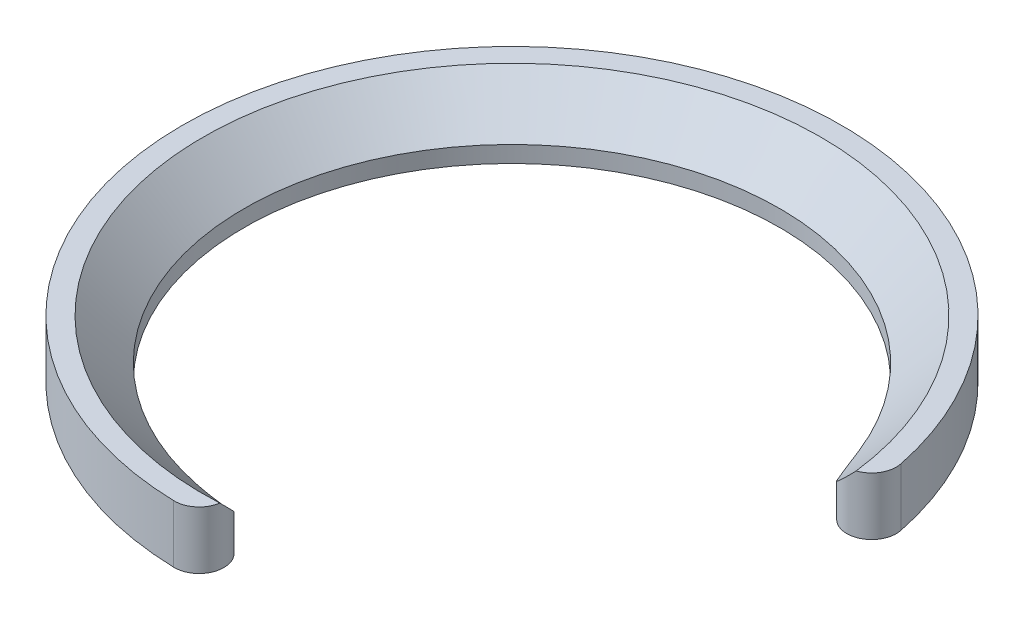
ISO-10303-21;
HEADER;
FILE_DESCRIPTION(('STEP AP214'),'2;1');
FILE_NAME('part.step','',(''),(''),'','','');
FILE_SCHEMA(('AUTOMOTIVE_DESIGN { 1 0 10303 214 1 1 1 1 }'));
ENDSEC;
DATA;
#1=APPLICATION_CONTEXT('core data for automotive mechanical design processes');
#2=APPLICATION_PROTOCOL_DEFINITION('international standard','automotive_design',2000,#1);
#3=PRODUCT_CONTEXT('',#1,'mechanical');
#4=PRODUCT('Part','Part','',(#3));
#5=PRODUCT_RELATED_PRODUCT_CATEGORY('part','',(#4));
#6=PRODUCT_DEFINITION_FORMATION('','',#4);
#7=PRODUCT_DEFINITION_CONTEXT('part definition',#1,'design');
#8=PRODUCT_DEFINITION('design','',#6,#7);
#9=PRODUCT_DEFINITION_SHAPE('','',#8);
#10=(LENGTH_UNIT() NAMED_UNIT(*) SI_UNIT(.MILLI.,.METRE.));
#11=(NAMED_UNIT(*) PLANE_ANGLE_UNIT() SI_UNIT($,.RADIAN.));
#12=(NAMED_UNIT(*) SI_UNIT($,.STERADIAN.) SOLID_ANGLE_UNIT());
#13=UNCERTAINTY_MEASURE_WITH_UNIT(LENGTH_MEASURE(1.E-05),#10,'distance_accuracy_value','');
#14=(GEOMETRIC_REPRESENTATION_CONTEXT(3) GLOBAL_UNCERTAINTY_ASSIGNED_CONTEXT((#13)) GLOBAL_UNIT_ASSIGNED_CONTEXT((#10,
#11,#12)) REPRESENTATION_CONTEXT('',''));
#15=CARTESIAN_POINT('',(0.,0.,0.));
#16=DIRECTION('',(0.,0.,1.));
#17=DIRECTION('',(1.,0.,0.));
#18=AXIS2_PLACEMENT_3D('',#15,#16,#17);
#19=CARTESIAN_POINT('',(2.77837084267106,0.,15.7569240481953));
#20=DIRECTION('',(0.,-1.,0.));
#21=DIRECTION('',(0.,0.,-1.));
#22=AXIS2_PLACEMENT_3D('',#19,#20,#21);
#23=PLANE('',#22);
#24=CARTESIAN_POINT('',(0.,0.,0.));
#25=DIRECTION('',(0.,-1.,0.));
#26=DIRECTION('',(0.,0.,-1.));
#27=AXIS2_PLACEMENT_3D('',#24,#25,#26);
#28=CIRCLE('',#27,16.);
#29=CARTESIAN_POINT('',(-0.425606111969566,0.,15.9943383557262));
#30=VERTEX_POINT('',#29);
#31=CARTESIAN_POINT('',(15.6774426912722,0.,-3.19652790725734));
#32=VERTEX_POINT('',#31);
#33=EDGE_CURVE('E165',#30,#32,#28,.T.);
#34=ORIENTED_EDGE('',*,*,#33,.T.);
#35=CARTESIAN_POINT('',(14.5016344894268,0.,-2.95678831421304));
#36=DIRECTION('',(0.,-1.,0.));
#37=DIRECTION('',(0.,0.,-1.));
#38=AXIS2_PLACEMENT_3D('',#35,#36,#37);
#39=CIRCLE('',#38,1.2);
#40=CARTESIAN_POINT('',(13.5600960107123,0.,-2.21280895085681));
#41=VERTEX_POINT('',#40);
#42=EDGE_CURVE('E42',#32,#41,#39,.T.);
#43=ORIENTED_EDGE('',*,*,#42,.T.);
#44=CARTESIAN_POINT('',(21.40625,0.,-8.41263697882537));
#45=DIRECTION('',(0.,-1.,0.));
#46=DIRECTION('',(0.,0.,-1.));
#47=AXIS2_PLACEMENT_3D('',#44,#45,#46);
#48=CIRCLE('',#47,10.);
#49=CARTESIAN_POINT('',(12.0991847826087,0.,-4.75496872716216));
#50=VERTEX_POINT('',#49);
#51=EDGE_CURVE('E99',#41,#50,#48,.T.);
#52=ORIENTED_EDGE('',*,*,#51,.T.);
#53=CARTESIAN_POINT('',(0.,0.,0.));
#54=DIRECTION('',(0.,-1.,0.));
#55=DIRECTION('',(0.,0.,-1.));
#56=AXIS2_PLACEMENT_3D('',#53,#54,#55);
#57=CIRCLE('',#56,13.);
#58=CARTESIAN_POINT('',(-2.58172867908429,0.,12.7410626333754));
#59=VERTEX_POINT('',#58);
#60=EDGE_CURVE('E100',#59,#50,#57,.T.);
#61=ORIENTED_EDGE('',*,*,#60,.F.);
#62=CARTESIAN_POINT('',(-4.56767381684143,0.,22.5418800436641));
#63=DIRECTION('',(0.,-1.,0.));
#64=DIRECTION('',(0.,0.,-1.));
#65=AXIS2_PLACEMENT_3D('',#62,#63,#64);
#66=CIRCLE('',#65,10.);
#67=CARTESIAN_POINT('',(0.175494550510368,0.,13.7383379247807));
#68=VERTEX_POINT('',#67);
#69=EDGE_CURVE('E92',#59,#68,#66,.T.);
#70=ORIENTED_EDGE('',*,*,#69,.T.);
#71=CARTESIAN_POINT('',(-0.393685653571849,0.,14.7947629790467));
#72=DIRECTION('',(0.,-1.,0.));
#73=DIRECTION('',(0.,0.,-1.));
#74=AXIS2_PLACEMENT_3D('',#71,#72,#73);
#75=CIRCLE('',#74,1.2);
#76=EDGE_CURVE('E163',#68,#30,#75,.T.);
#77=ORIENTED_EDGE('',*,*,#76,.T.);
#78=EDGE_LOOP('',(#34,#43,#52,#61,#70,#77));
#79=FACE_BOUND('',#78,.T.);
#80=ADVANCED_FACE('F33',(#79),#23,.T.);
#81=CARTESIAN_POINT('',(0.,0.,0.));
#82=DIRECTION('',(0.,-1.,0.));
#83=DIRECTION('',(0.,0.,-1.));
#84=AXIS2_PLACEMENT_3D('',#81,#82,#83);
#85=CYLINDRICAL_SURFACE('',#84,13.);
#86=ORIENTED_EDGE('',*,*,#60,.T.);
#87=DIRECTION('',(0.,-1.,0.));
#88=VECTOR('',#87,1.);
#89=CARTESIAN_POINT('',(12.0991847826087,0.,-4.75496872716216));
#90=LINE('',#89,#88);
#91=CARTESIAN_POINT('',(12.0991847826087,0.8,-4.75496872716216));
#92=VERTEX_POINT('',#91);
#93=EDGE_CURVE('E109',#50,#92,#90,.F.);
#94=ORIENTED_EDGE('',*,*,#93,.T.);
#95=CARTESIAN_POINT('',(0.,0.8,0.));
#96=DIRECTION('',(0.,-1.,0.));
#97=DIRECTION('',(0.,0.,-1.));
#98=AXIS2_PLACEMENT_3D('',#95,#96,#97);
#99=CIRCLE('',#98,13.);
#100=CARTESIAN_POINT('',(-2.58172867908429,0.8,12.7410626333754));
#101=VERTEX_POINT('',#100);
#102=EDGE_CURVE('E108',#101,#92,#99,.T.);
#103=ORIENTED_EDGE('',*,*,#102,.F.);
#104=DIRECTION('',(0.,-1.,0.));
#105=VECTOR('',#104,1.);
#106=CARTESIAN_POINT('',(-2.58172867908429,0.,12.7410626333754));
#107=LINE('',#106,#105);
#108=EDGE_CURVE('E95',#101,#59,#107,.T.);
#109=ORIENTED_EDGE('',*,*,#108,.T.);
#110=EDGE_LOOP('',(#86,#94,#103,#109));
#111=FACE_BOUND('',#110,.T.);
#112=ADVANCED_FACE('F105',(#111),#85,.F.);
#113=CARTESIAN_POINT('',(0.,2.8,0.));
#114=DIRECTION('',(0.,1.,0.));
#115=DIRECTION('',(0.,0.,1.));
#116=AXIS2_PLACEMENT_3D('',#113,#114,#115);
#117=CONICAL_SURFACE('',#116,15.,0.785398163397436);
#118=CARTESIAN_POINT('',(12.0991847826087,0.8,-4.75496872716216));
#119=CARTESIAN_POINT('',(12.1315621627603,0.799994638125784,-4.67257757058638));
#120=CARTESIAN_POINT('',(12.1650314499625,0.802080727480974,-4.59063464278929));
#121=CARTESIAN_POINT('',(12.2340464967303,0.810380748747397,-4.42785455486851));
#122=CARTESIAN_POINT('',(12.2695919238559,0.816594021441003,-4.34701722025719));
#123=CARTESIAN_POINT('',(12.3790193485658,0.841302834282617,-4.10682922955109));
#124=CARTESIAN_POINT('',(12.4558513679309,0.865867925003011,-3.94939897905469));
#125=CARTESIAN_POINT('',(12.6150217495577,0.929599013464066,-3.64361190808463));
#126=CARTESIAN_POINT('',(12.6972587626096,0.968537594639024,-3.49515359802959));
#127=CARTESIAN_POINT('',(12.8672584243904,1.05955085603497,-3.20554190353635));
#128=CARTESIAN_POINT('',(12.9550240843157,1.11163274204043,-3.06439257755719));
#129=CARTESIAN_POINT('',(13.1560373200793,1.24068481995433,-2.75799959820432));
#130=CARTESIAN_POINT('',(13.2704644184474,1.32062622377953,-2.59478602331351));
#131=CARTESIAN_POINT('',(13.5047526697772,1.49479769654004,-2.28036003391767));
#132=CARTESIAN_POINT('',(13.6246156187214,1.58903251242742,-2.1291516319336));
#133=CARTESIAN_POINT('',(13.8693217404861,1.78958688890682,-1.83759831555423));
#134=CARTESIAN_POINT('',(13.9941883651039,1.89596912080986,-1.69731665573163));
#135=CARTESIAN_POINT('',(14.247458008576,2.11807451903128,-1.42794910469554));
#136=CARTESIAN_POINT('',(14.3758598801441,2.23379467793201,-1.29885963643683));
#137=CARTESIAN_POINT('',(14.5841990589345,2.42541716845927,-1.10022519586018));
#138=CARTESIAN_POINT('',(14.6631883831737,2.49893622240105,-1.02734749275982));
#139=CARTESIAN_POINT('',(14.8217187709406,2.64796549535446,-0.885674136825805));
#140=CARTESIAN_POINT('',(14.9012540422702,2.72346181868481,-0.816857403705815));
#141=CARTESIAN_POINT('',(14.9812492400598,2.8,-0.749780772764378));
#142=B_SPLINE_CURVE_WITH_KNOTS('',3,(#118,#119,#120,#121,#122,#123,#124,#125,#126,#127,#128,
#129,#130,#131,#132,#133,#134,#135,#136,#137,#138,#139,#140,#141),.UNSPECIFIED.,.F.,.F.,(4,2,2,
2,2,2,2,2,2,2,2,4),(0.,0.265506843755294,0.530971289413886,1.06060566415018,1.58219624778753,
2.10407341579457,2.74731222742248,3.39076513324984,4.03770208026318,4.68443149692982,
5.07500161338451,5.46332378224054),.UNSPECIFIED.);
#143=CARTESIAN_POINT('',(13.5600960107123,1.53945876927937,-2.21280895085681));
#144=VERTEX_POINT('',#143);
#145=EDGE_CURVE('E126',#92,#144,#142,.T.);
#146=ORIENTED_EDGE('',*,*,#145,.T.);
#147=CARTESIAN_POINT('',(13.5600960107123,1.53945876927937,-2.21280895085681));
#148=CARTESIAN_POINT('',(13.5829280354595,1.55734124231673,-2.18392156370197));
#149=CARTESIAN_POINT('',(13.6066640017661,1.57648027334643,-2.15660712489448));
#150=CARTESIAN_POINT('',(13.6555559180798,1.61682667388487,-2.10507720309663));
#151=CARTESIAN_POINT('',(13.6807086241254,1.63802939319297,-2.08085502461041));
#152=CARTESIAN_POINT('',(13.7573760724089,1.70377266753063,-2.01301420266121));
#153=CARTESIAN_POINT('',(13.8105508551059,1.7508068350993,-1.97367215230235));
#154=CARTESIAN_POINT('',(13.9373906990975,1.86542166497028,-1.89427271297125));
#155=CARTESIAN_POINT('',(14.0120319099722,1.93466430764346,-1.85825480258233));
#156=CARTESIAN_POINT('',(14.1635568934512,2.07775117791376,-1.80255782337397));
#157=CARTESIAN_POINT('',(14.2404505212639,2.15161802584148,-1.7829671278865));
#158=CARTESIAN_POINT('',(14.3965376408674,2.3035490032904,-1.75872359301174));
#159=CARTESIAN_POINT('',(14.4757366497157,2.38167266298555,-1.75449283024606));
#160=CARTESIAN_POINT('',(14.6326516094012,2.53828091886025,-1.76138698928973));
#161=CARTESIAN_POINT('',(14.7103713199002,2.61676370987749,-1.77246552739357));
#162=CARTESIAN_POINT('',(14.8211061856491,2.72995691386472,-1.79955674350745));
#163=CARTESIAN_POINT('',(14.855261116399,2.76506629307802,-1.80953066490364));
#164=CARTESIAN_POINT('',(14.8890493342228,2.8,-1.82104638136393));
#165=B_SPLINE_CURVE_WITH_KNOTS('',3,(#147,#148,#149,#150,#151,#152,#153,#154,#155,#156,#157,
#158,#159,#160,#161,#162,#163,#164),.UNSPECIFIED.,.F.,.F.,(4,2,2,2,2,2,2,2,4),(0.,
0.122653185802559,0.2450361230348,0.48745080813829,0.809777723572738,1.13382773130375,
1.46671767228087,1.79860124062713,1.94845875767843),.UNSPECIFIED.);
#166=CARTESIAN_POINT('',(14.8890493342228,2.8,-1.82104638136398));
#167=VERTEX_POINT('',#166);
#168=EDGE_CURVE('E145',#144,#167,#165,.T.);
#169=ORIENTED_EDGE('',*,*,#168,.T.);
#170=CARTESIAN_POINT('',(0.,2.8,0.));
#171=DIRECTION('',(0.,-1.,0.));
#172=DIRECTION('',(0.,0.,-1.));
#173=AXIS2_PLACEMENT_3D('',#170,#171,#172);
#174=CIRCLE('',#173,15.);
#175=CARTESIAN_POINT('',(0.792075689118914,2.8,14.9790726048946));
#176=VERTEX_POINT('',#175);
#177=EDGE_CURVE('E113',#176,#167,#174,.T.);
#178=ORIENTED_EDGE('',*,*,#177,.F.);
#179=CARTESIAN_POINT('',(0.792075689118914,2.8,14.9790726048946));
#180=CARTESIAN_POINT('',(0.799348082255004,2.75357413458654,14.9321941133652));
#181=CARTESIAN_POINT('',(0.803823463031357,2.70686433258526,14.8851760086493));
#182=CARTESIAN_POINT('',(0.807234594005238,2.61317327165375,14.7911635094407));
#183=CARTESIAN_POINT('',(0.806167712358813,2.56619189434048,14.7441691368127));
#184=CARTESIAN_POINT('',(0.798483358021839,2.47157792969103,14.6498334316328));
#185=CARTESIAN_POINT('',(0.791780906731315,2.42394642022493,14.6024978518205));
#186=CARTESIAN_POINT('',(0.772672770103929,2.32913170379343,14.5085730457935));
#187=CARTESIAN_POINT('',(0.760268529412874,2.28194838635982,14.4619836336169));
#188=CARTESIAN_POINT('',(0.720508580193409,2.16053900897108,14.3424684159174));
#189=CARTESIAN_POINT('',(0.688648221370836,2.08691734774851,14.2703570296443));
#190=CARTESIAN_POINT('',(0.60941527312693,1.94441710053816,14.1313297067864));
#191=CARTESIAN_POINT('',(0.562176172831348,1.8755036627234,14.0643749839277));
#192=CARTESIAN_POINT('',(0.462609004366405,1.75908868456247,13.9514834920164));
#193=CARTESIAN_POINT('',(0.413594546972874,1.71018082019569,13.9041339202096));
#194=CARTESIAN_POINT('',(0.331336364277594,1.64183278635367,13.8378927951885));
#195=CARTESIAN_POINT('',(0.302267522782192,1.61977335735037,13.8165004127222));
#196=CARTESIAN_POINT('',(0.24113361673338,1.57784364859975,13.7757662500943));
#197=CARTESIAN_POINT('',(0.209061594946231,1.55797869666078,13.756429464673));
#198=CARTESIAN_POINT('',(0.175494550510392,1.53945876927936,13.7383379247807));
#199=B_SPLINE_CURVE_WITH_KNOTS('',3,(#179,#180,#181,#182,#183,#184,#185,#186,#187,#188,#189,
#190,#191,#192,#193,#194,#195,#196,#197,#198),.UNSPECIFIED.,.F.,.F.,(4,2,2,2,2,2,2,2,2,4),(0.,
0.199055447530467,0.398205428792977,0.600413387599095,0.802570141778071,1.12494592978169,
1.44459491353168,1.6950693511513,1.82177618567994,1.94878417815852),.UNSPECIFIED.);
#200=CARTESIAN_POINT('',(0.175494550510369,1.53945876927937,13.7383379247807));
#201=VERTEX_POINT('',#200);
#202=EDGE_CURVE('E152',#176,#201,#199,.T.);
#203=ORIENTED_EDGE('',*,*,#202,.T.);
#204=CARTESIAN_POINT('',(1.8630767116328,2.8,14.8838484662593));
#205=CARTESIAN_POINT('',(1.7333057239565,2.67581623383287,14.7749039110585));
#206=CARTESIAN_POINT('',(1.59922539168491,2.55429040394643,14.667908367789));
#207=CARTESIAN_POINT('',(1.32161975387374,2.31785782733696,14.4581508731364));
#208=CARTESIAN_POINT('',(1.17807628118789,2.20296465625542,14.3553977194191));
#209=CARTESIAN_POINT('',(0.878710073795735,1.97972724648517,14.1531958808364));
#210=CARTESIAN_POINT('',(0.72272037351358,1.87152712344218,14.0538327943472));
#211=CARTESIAN_POINT('',(0.40035188278474,1.66609908014195,13.8612109374594));
#212=CARTESIAN_POINT('',(0.233981076056721,1.5688628856322,13.7679475863433));
#213=CARTESIAN_POINT('',(-0.199794741694792,1.34036020986853,13.541399089913));
#214=CARTESIAN_POINT('',(-0.474532063067128,1.21789404841711,13.412693832104));
#215=CARTESIAN_POINT('',(-0.903209231443151,1.06619851840968,13.2362145169148));
#216=CARTESIAN_POINT('',(-1.04831942526591,1.02107146451152,13.1803205545461));
#217=CARTESIAN_POINT('',(-1.34376578304193,0.9425103054769,13.0745146593765));
#218=CARTESIAN_POINT('',(-1.49409920404482,0.909070162084221,13.0245996462303));
#219=CARTESIAN_POINT('',(-1.79858482955504,0.855150728567519,12.9316074672296));
#220=CARTESIAN_POINT('',(-1.9527221669948,0.834627376182699,12.8885074348274));
#221=CARTESIAN_POINT('',(-2.26485163298982,0.806969654933245,12.8092911448756));
#222=CARTESIAN_POINT('',(-2.42286013813734,0.799908529739229,12.773214045185));
#223=CARTESIAN_POINT('',(-2.58172867908429,0.799999999999997,12.7410626333753));
#224=B_SPLINE_CURVE_WITH_KNOTS('',3,(#204,#205,#206,#207,#208,#209,#210,#211,#212,#213,#214,
#215,#216,#217,#218,#219,#220,#221,#222,#223),.UNSPECIFIED.,.F.,.F.,(4,2,2,2,2,2,2,2,2,4),(0.,
0.630265893074497,1.26177912914812,1.90400269046603,2.54573828816302,3.52311336776863,
4.0083681491469,4.49337184281945,4.97671197557401,5.46267438549736),.UNSPECIFIED.);
#225=EDGE_CURVE('E119',#201,#101,#224,.T.);
#226=ORIENTED_EDGE('',*,*,#225,.T.);
#227=ORIENTED_EDGE('',*,*,#102,.T.);
#228=EDGE_LOOP('',(#146,#169,#178,#203,#226,#227));
#229=FACE_BOUND('',#228,.T.);
#230=ADVANCED_FACE('F132',(#229),#117,.F.);
#231=CARTESIAN_POINT('',(2.60472266500411,2.8,14.772116295183));
#232=DIRECTION('',(0.,1.,0.));
#233=DIRECTION('',(0.,0.,1.));
#234=AXIS2_PLACEMENT_3D('',#231,#232,#233);
#235=PLANE('',#234);
#236=ORIENTED_EDGE('',*,*,#177,.T.);
#237=CARTESIAN_POINT('',(14.5016344894268,2.8,-2.95678831421304));
#238=DIRECTION('',(0.,1.,0.));
#239=DIRECTION('',(0.,0.,1.));
#240=AXIS2_PLACEMENT_3D('',#237,#238,#239);
#241=CIRCLE('',#240,1.2);
#242=CARTESIAN_POINT('',(15.6774426912722,2.8,-3.19652790725734));
#243=VERTEX_POINT('',#242);
#244=EDGE_CURVE('E157',#167,#243,#241,.T.);
#245=ORIENTED_EDGE('',*,*,#244,.T.);
#246=CARTESIAN_POINT('',(0.,2.8,0.));
#247=DIRECTION('',(0.,-1.,0.));
#248=DIRECTION('',(0.,0.,-1.));
#249=AXIS2_PLACEMENT_3D('',#246,#247,#248);
#250=CIRCLE('',#249,16.);
#251=CARTESIAN_POINT('',(-0.425606111969566,2.8,15.9943383557262));
#252=VERTEX_POINT('',#251);
#253=EDGE_CURVE('E181',#252,#243,#250,.T.);
#254=ORIENTED_EDGE('',*,*,#253,.F.);
#255=CARTESIAN_POINT('',(-0.393685653571849,2.8,14.7947629790467));
#256=DIRECTION('',(0.,1.,0.));
#257=DIRECTION('',(0.,0.,1.));
#258=AXIS2_PLACEMENT_3D('',#255,#256,#257);
#259=CIRCLE('',#258,1.2);
#260=EDGE_CURVE('E151',#252,#176,#259,.T.);
#261=ORIENTED_EDGE('',*,*,#260,.T.);
#262=EDGE_LOOP('',(#236,#245,#254,#261));
#263=FACE_BOUND('',#262,.T.);
#264=ADVANCED_FACE('F185',(#263),#235,.T.);
#265=CARTESIAN_POINT('',(0.,0.,0.));
#266=DIRECTION('',(0.,-1.,0.));
#267=DIRECTION('',(0.,0.,-1.));
#268=AXIS2_PLACEMENT_3D('',#265,#266,#267);
#269=CYLINDRICAL_SURFACE('',#268,16.);
#270=ORIENTED_EDGE('',*,*,#253,.T.);
#271=DIRECTION('',(0.,-1.,0.));
#272=VECTOR('',#271,1.);
#273=CARTESIAN_POINT('',(15.6774426912722,0.,-3.19652790725734));
#274=LINE('',#273,#272);
#275=EDGE_CURVE('E55',#243,#32,#274,.T.);
#276=ORIENTED_EDGE('',*,*,#275,.T.);
#277=ORIENTED_EDGE('',*,*,#33,.F.);
#278=DIRECTION('',(0.,-1.,0.));
#279=VECTOR('',#278,1.);
#280=CARTESIAN_POINT('',(-0.425606111969566,0.,15.9943383557262));
#281=LINE('',#280,#279);
#282=EDGE_CURVE('E159',#30,#252,#281,.F.);
#283=ORIENTED_EDGE('',*,*,#282,.T.);
#284=EDGE_LOOP('',(#270,#276,#277,#283));
#285=FACE_BOUND('',#284,.T.);
#286=ADVANCED_FACE('F179',(#285),#269,.T.);
#287=CARTESIAN_POINT('',(21.40625,0.,-8.41263697882537));
#288=DIRECTION('',(0.,-1.,0.));
#289=DIRECTION('',(0.,0.,-1.));
#290=AXIS2_PLACEMENT_3D('',#287,#288,#289);
#291=CYLINDRICAL_SURFACE('',#290,10.);
#292=ORIENTED_EDGE('',*,*,#51,.F.);
#293=DIRECTION('',(0.,-1.,0.));
#294=VECTOR('',#293,1.);
#295=CARTESIAN_POINT('',(13.5600960107123,0.,-2.21280895085681));
#296=LINE('',#295,#294);
#297=EDGE_CURVE('E170',#41,#144,#296,.F.);
#298=ORIENTED_EDGE('',*,*,#297,.T.);
#299=ORIENTED_EDGE('',*,*,#145,.F.);
#300=ORIENTED_EDGE('',*,*,#93,.F.);
#301=EDGE_LOOP('',(#292,#298,#299,#300));
#302=FACE_BOUND('',#301,.T.);
#303=ADVANCED_FACE('F139',(#302),#291,.T.);
#304=CARTESIAN_POINT('',(-4.56767381684143,0.,22.5418800436641));
#305=DIRECTION('',(0.,-1.,0.));
#306=DIRECTION('',(0.,0.,-1.));
#307=AXIS2_PLACEMENT_3D('',#304,#305,#306);
#308=CYLINDRICAL_SURFACE('',#307,10.);
#309=ORIENTED_EDGE('',*,*,#225,.F.);
#310=DIRECTION('',(0.,-1.,0.));
#311=VECTOR('',#310,1.);
#312=CARTESIAN_POINT('',(0.17549455051037,0.,13.7383379247807));
#313=LINE('',#312,#311);
#314=EDGE_CURVE('E11',#201,#68,#313,.T.);
#315=ORIENTED_EDGE('',*,*,#314,.T.);
#316=ORIENTED_EDGE('',*,*,#69,.F.);
#317=ORIENTED_EDGE('',*,*,#108,.F.);
#318=EDGE_LOOP('',(#309,#315,#316,#317));
#319=FACE_BOUND('',#318,.T.);
#320=ADVANCED_FACE('F94',(#319),#308,.T.);
#321=CARTESIAN_POINT('',(14.5016344894268,0.,-2.95678831421304));
#322=DIRECTION('',(0.,1.,0.));
#323=DIRECTION('',(0.,0.,1.));
#324=AXIS2_PLACEMENT_3D('',#321,#322,#323);
#325=CYLINDRICAL_SURFACE('',#324,1.2);
#326=ORIENTED_EDGE('',*,*,#42,.F.);
#327=ORIENTED_EDGE('',*,*,#275,.F.);
#328=ORIENTED_EDGE('',*,*,#244,.F.);
#329=ORIENTED_EDGE('',*,*,#168,.F.);
#330=ORIENTED_EDGE('',*,*,#297,.F.);
#331=EDGE_LOOP('',(#326,#327,#328,#329,#330));
#332=FACE_BOUND('',#331,.T.);
#333=ADVANCED_FACE('F138',(#332),#325,.T.);
#334=CARTESIAN_POINT('',(-0.393685653571849,0.,14.7947629790467));
#335=DIRECTION('',(0.,1.,0.));
#336=DIRECTION('',(0.,0.,1.));
#337=AXIS2_PLACEMENT_3D('',#334,#335,#336);
#338=CYLINDRICAL_SURFACE('',#337,1.2);
#339=ORIENTED_EDGE('',*,*,#76,.F.);
#340=ORIENTED_EDGE('',*,*,#314,.F.);
#341=ORIENTED_EDGE('',*,*,#202,.F.);
#342=ORIENTED_EDGE('',*,*,#260,.F.);
#343=ORIENTED_EDGE('',*,*,#282,.F.);
#344=EDGE_LOOP('',(#339,#340,#341,#342,#343));
#345=FACE_BOUND('',#344,.T.);
#346=ADVANCED_FACE('F35',(#345),#338,.T.);
#347=CLOSED_SHELL('',(#80,#112,#230,#264,#286,#303,#320,#333,#346));
#348=MANIFOLD_SOLID_BREP('B2',#347);
#349=ADVANCED_BREP_SHAPE_REPRESENTATION('',(#18,#348),#14);
#350=SHAPE_DEFINITION_REPRESENTATION(#9,#349);
ENDSEC;
END-ISO-10303-21;
